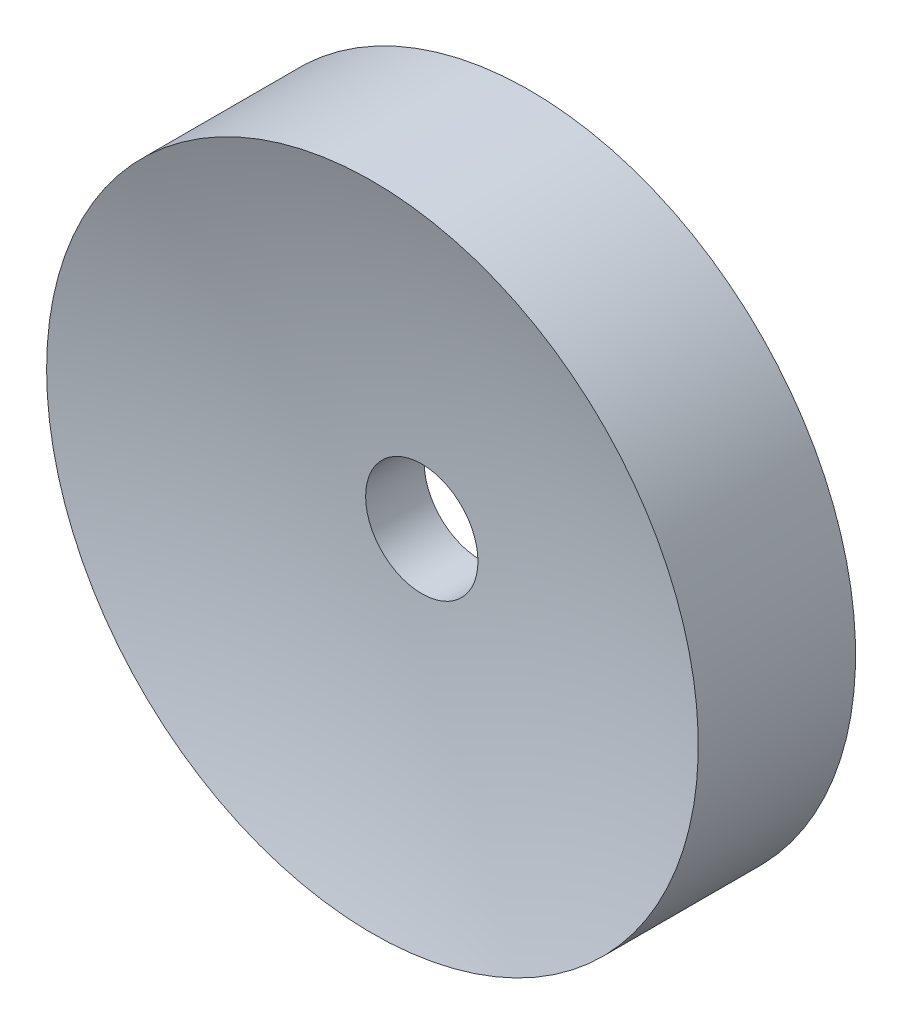
ISO-10303-21;
HEADER;
FILE_DESCRIPTION(('STEP AP214'),'2;1');
FILE_NAME('part.step','',(''),(''),'','','');
FILE_SCHEMA(('AUTOMOTIVE_DESIGN { 1 0 10303 214 1 1 1 1 }'));
ENDSEC;
DATA;
#1=APPLICATION_CONTEXT('core data for automotive mechanical design processes');
#2=APPLICATION_PROTOCOL_DEFINITION('international standard','automotive_design',2000,#1);
#3=PRODUCT_CONTEXT('',#1,'mechanical');
#4=PRODUCT('Part','Part','',(#3));
#5=PRODUCT_RELATED_PRODUCT_CATEGORY('part','',(#4));
#6=PRODUCT_DEFINITION_FORMATION('','',#4);
#7=PRODUCT_DEFINITION_CONTEXT('part definition',#1,'design');
#8=PRODUCT_DEFINITION('design','',#6,#7);
#9=PRODUCT_DEFINITION_SHAPE('','',#8);
#10=(LENGTH_UNIT() NAMED_UNIT(*) SI_UNIT(.MILLI.,.METRE.));
#11=(NAMED_UNIT(*) PLANE_ANGLE_UNIT() SI_UNIT($,.RADIAN.));
#12=(NAMED_UNIT(*) SI_UNIT($,.STERADIAN.) SOLID_ANGLE_UNIT());
#13=UNCERTAINTY_MEASURE_WITH_UNIT(LENGTH_MEASURE(1.E-05),#10,'distance_accuracy_value','');
#14=(GEOMETRIC_REPRESENTATION_CONTEXT(3) GLOBAL_UNCERTAINTY_ASSIGNED_CONTEXT((#13)) GLOBAL_UNIT_ASSIGNED_CONTEXT((#10,
#11,#12)) REPRESENTATION_CONTEXT('',''));
#15=CARTESIAN_POINT('',(0.,0.,0.));
#16=DIRECTION('',(0.,0.,1.));
#17=DIRECTION('',(1.,0.,0.));
#18=AXIS2_PLACEMENT_3D('',#15,#16,#17);
#19=CARTESIAN_POINT('',(0.,0.,1.75));
#20=DIRECTION('',(0.,0.,-1.));
#21=DIRECTION('',(-1.,0.,0.));
#22=AXIS2_PLACEMENT_3D('',#19,#20,#21);
#23=CYLINDRICAL_SURFACE('',#22,1.25);
#24=CARTESIAN_POINT('',(0.,0.,-0.651865141234716));
#25=DIRECTION('',(0.,0.,-1.));
#26=DIRECTION('',(-1.,0.,0.));
#27=AXIS2_PLACEMENT_3D('',#24,#25,#26);
#28=CIRCLE('',#27,1.25);
#29=CARTESIAN_POINT('',(-1.25,0.,-0.651865141234716));
#30=VERTEX_POINT('',#29);
#31=EDGE_CURVE('E12',#30,#30,#28,.T.);
#32=ORIENTED_EDGE('',*,*,#31,.T.);
#33=EDGE_LOOP('',(#32));
#34=FACE_BOUND('',#33,.T.);
#35=CARTESIAN_POINT('',(0.,0.,0.651865141234716));
#36=DIRECTION('',(0.,0.,1.));
#37=DIRECTION('',(1.,0.,0.));
#38=AXIS2_PLACEMENT_3D('',#35,#36,#37);
#39=CIRCLE('',#38,1.25);
#40=CARTESIAN_POINT('',(1.25,0.,0.651865141234716));
#41=VERTEX_POINT('',#40);
#42=EDGE_CURVE('E53',#41,#41,#39,.T.);
#43=ORIENTED_EDGE('',*,*,#42,.T.);
#44=EDGE_LOOP('',(#43));
#45=FACE_BOUND('',#44,.T.);
#46=ADVANCED_FACE('F42',(#34,#45),#23,.F.);
#47=CARTESIAN_POINT('',(0.,0.,1.75));
#48=DIRECTION('',(0.,0.,-1.));
#49=DIRECTION('',(-1.,0.,0.));
#50=AXIS2_PLACEMENT_3D('',#47,#48,#49);
#51=CYLINDRICAL_SURFACE('',#50,7.25);
#52=CARTESIAN_POINT('',(0.,0.,1.75));
#53=DIRECTION('',(0.,0.,-1.));
#54=DIRECTION('',(-1.,0.,0.));
#55=AXIS2_PLACEMENT_3D('',#52,#53,#54);
#56=CIRCLE('',#55,7.25);
#57=CARTESIAN_POINT('',(-7.25,0.,1.75));
#58=VERTEX_POINT('',#57);
#59=EDGE_CURVE('E57',#58,#58,#56,.T.);
#60=ORIENTED_EDGE('',*,*,#59,.T.);
#61=EDGE_LOOP('',(#60));
#62=FACE_BOUND('',#61,.T.);
#63=CARTESIAN_POINT('',(0.,0.,-1.75));
#64=DIRECTION('',(0.,0.,-1.));
#65=DIRECTION('',(-1.,0.,0.));
#66=AXIS2_PLACEMENT_3D('',#63,#64,#65);
#67=CIRCLE('',#66,7.25);
#68=CARTESIAN_POINT('',(-7.25,0.,-1.75));
#69=VERTEX_POINT('',#68);
#70=EDGE_CURVE('E49',#69,#69,#67,.T.);
#71=ORIENTED_EDGE('',*,*,#70,.F.);
#72=EDGE_LOOP('',(#71));
#73=FACE_BOUND('',#72,.T.);
#74=ADVANCED_FACE('F44',(#62,#73),#51,.T.);
#75=CARTESIAN_POINT('',(0.,0.,-24.4221242088388));
#76=DIRECTION('',(0.,0.,-1.));
#77=DIRECTION('',(1.,0.,0.));
#78=AXIS2_PLACEMENT_3D('',#75,#76,#77);
#79=SPHERICAL_SURFACE('',#78,23.8031030779815);
#80=ORIENTED_EDGE('',*,*,#31,.F.);
#81=EDGE_LOOP('',(#80));
#82=FACE_BOUND('',#81,.T.);
#83=ORIENTED_EDGE('',*,*,#70,.T.);
#84=EDGE_LOOP('',(#83));
#85=FACE_BOUND('',#84,.T.);
#86=ADVANCED_FACE('F67',(#82,#85),#79,.F.);
#87=CARTESIAN_POINT('',(0.,0.,24.4221242088388));
#88=DIRECTION('',(0.,0.,1.));
#89=DIRECTION('',(1.,0.,0.));
#90=AXIS2_PLACEMENT_3D('',#87,#88,#89);
#91=SPHERICAL_SURFACE('',#90,23.8031030779815);
#92=ORIENTED_EDGE('',*,*,#42,.F.);
#93=EDGE_LOOP('',(#92));
#94=FACE_BOUND('',#93,.T.);
#95=ORIENTED_EDGE('',*,*,#59,.F.);
#96=EDGE_LOOP('',(#95));
#97=FACE_BOUND('',#96,.T.);
#98=ADVANCED_FACE('F65',(#94,#97),#91,.F.);
#99=CLOSED_SHELL('',(#46,#74,#86,#98));
#100=MANIFOLD_SOLID_BREP('B2',#99);
#101=ADVANCED_BREP_SHAPE_REPRESENTATION('',(#18,#100),#14);
#102=SHAPE_DEFINITION_REPRESENTATION(#9,#101);
ENDSEC;
END-ISO-10303-21;
